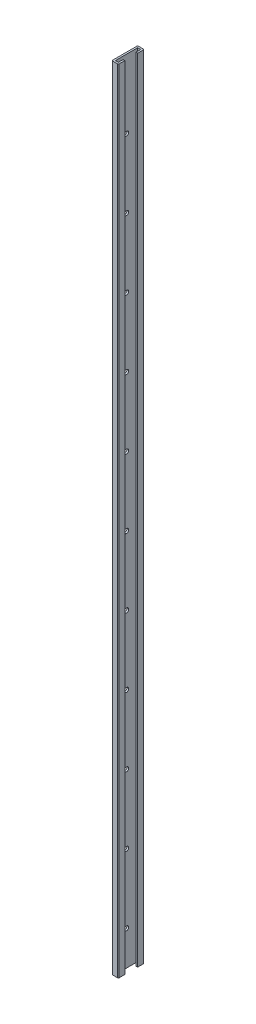
ISO-10303-21;
HEADER;
FILE_DESCRIPTION(('STEP AP214'),'2;1');
FILE_NAME('part.step','',(''),(''),'','','');
FILE_SCHEMA(('AUTOMOTIVE_DESIGN { 1 0 10303 214 1 1 1 1 }'));
ENDSEC;
DATA;
#1=APPLICATION_CONTEXT('core data for automotive mechanical design processes');
#2=APPLICATION_PROTOCOL_DEFINITION('international standard','automotive_design',2000,#1);
#3=PRODUCT_CONTEXT('',#1,'mechanical');
#4=PRODUCT('Part','Part','',(#3));
#5=PRODUCT_RELATED_PRODUCT_CATEGORY('part','',(#4));
#6=PRODUCT_DEFINITION_FORMATION('','',#4);
#7=PRODUCT_DEFINITION_CONTEXT('part definition',#1,'design');
#8=PRODUCT_DEFINITION('design','',#6,#7);
#9=PRODUCT_DEFINITION_SHAPE('','',#8);
#10=(LENGTH_UNIT() NAMED_UNIT(*) SI_UNIT(.MILLI.,.METRE.));
#11=(NAMED_UNIT(*) PLANE_ANGLE_UNIT() SI_UNIT($,.RADIAN.));
#12=(NAMED_UNIT(*) SI_UNIT($,.STERADIAN.) SOLID_ANGLE_UNIT());
#13=UNCERTAINTY_MEASURE_WITH_UNIT(LENGTH_MEASURE(1.E-05),#10,'distance_accuracy_value','');
#14=(GEOMETRIC_REPRESENTATION_CONTEXT(3) GLOBAL_UNCERTAINTY_ASSIGNED_CONTEXT((#13)) GLOBAL_UNIT_ASSIGNED_CONTEXT((#10,
#11,#12)) REPRESENTATION_CONTEXT('',''));
#15=CARTESIAN_POINT('',(0.,0.,0.));
#16=DIRECTION('',(0.,0.,1.));
#17=DIRECTION('',(1.,0.,0.));
#18=AXIS2_PLACEMENT_3D('',#15,#16,#17);
#19=CARTESIAN_POINT('',(2.54,1168.4,0.));
#20=DIRECTION('',(0.,0.,1.));
#21=DIRECTION('',(1.,0.,0.));
#22=AXIS2_PLACEMENT_3D('',#19,#20,#21);
#23=PLANE('',#22);
#24=DIRECTION('',(-1.,0.,0.));
#25=VECTOR('',#24,1.);
#26=CARTESIAN_POINT('',(2.54,0.,0.));
#27=LINE('',#26,#25);
#28=CARTESIAN_POINT('',(6.985,0.,0.));
#29=VERTEX_POINT('',#28);
#30=CARTESIAN_POINT('',(2.54,0.,0.));
#31=VERTEX_POINT('',#30);
#32=EDGE_CURVE('E220',#29,#31,#27,.T.);
#33=ORIENTED_EDGE('',*,*,#32,.T.);
#34=DIRECTION('',(0.,-1.,0.));
#35=VECTOR('',#34,1.);
#36=CARTESIAN_POINT('',(2.54,1168.4,0.));
#37=LINE('',#36,#35);
#38=CARTESIAN_POINT('',(2.54,1168.4,0.));
#39=VERTEX_POINT('',#38);
#40=EDGE_CURVE('E11',#39,#31,#37,.T.);
#41=ORIENTED_EDGE('',*,*,#40,.F.);
#42=DIRECTION('',(-1.,0.,0.));
#43=VECTOR('',#42,1.);
#44=CARTESIAN_POINT('',(2.54,1168.4,0.));
#45=LINE('',#44,#43);
#46=CARTESIAN_POINT('',(6.985,1168.4,0.));
#47=VERTEX_POINT('',#46);
#48=EDGE_CURVE('E267',#47,#39,#45,.T.);
#49=ORIENTED_EDGE('',*,*,#48,.F.);
#50=DIRECTION('',(0.,-1.,0.));
#51=VECTOR('',#50,1.);
#52=CARTESIAN_POINT('',(6.985,1168.4,0.));
#53=LINE('',#52,#51);
#54=EDGE_CURVE('E216',#47,#29,#53,.T.);
#55=ORIENTED_EDGE('',*,*,#54,.T.);
#56=EDGE_LOOP('',(#33,#41,#49,#55));
#57=FACE_BOUND('',#56,.T.);
#58=ADVANCED_FACE('F38',(#57),#23,.F.);
#59=CARTESIAN_POINT('',(2.54,1168.4,0.));
#60=DIRECTION('',(-1.,0.,0.));
#61=DIRECTION('',(0.,0.,1.));
#62=AXIS2_PLACEMENT_3D('',#59,#60,#61);
#63=PLANE('',#62);
#64=CARTESIAN_POINT('',(2.54,50.8,-16.51));
#65=DIRECTION('',(1.,0.,0.));
#66=DIRECTION('',(0.,0.,-1.));
#67=AXIS2_PLACEMENT_3D('',#64,#65,#66);
#68=CIRCLE('',#67,3.175);
#69=CARTESIAN_POINT('',(2.54,50.8,-19.685));
#70=VERTEX_POINT('',#69);
#71=EDGE_CURVE('E451',#70,#70,#68,.T.);
#72=ORIENTED_EDGE('',*,*,#71,.F.);
#73=EDGE_LOOP('',(#72));
#74=FACE_BOUND('',#73,.T.);
#75=CARTESIAN_POINT('',(2.54,152.4,-16.51));
#76=DIRECTION('',(1.,0.,0.));
#77=DIRECTION('',(0.,0.,-1.));
#78=AXIS2_PLACEMENT_3D('',#75,#76,#77);
#79=CIRCLE('',#78,3.175);
#80=CARTESIAN_POINT('',(2.54,152.4,-19.685));
#81=VERTEX_POINT('',#80);
#82=EDGE_CURVE('E443',#81,#81,#79,.T.);
#83=ORIENTED_EDGE('',*,*,#82,.F.);
#84=EDGE_LOOP('',(#83));
#85=FACE_BOUND('',#84,.T.);
#86=CARTESIAN_POINT('',(2.54,254.,-16.51));
#87=DIRECTION('',(1.,0.,0.));
#88=DIRECTION('',(0.,0.,-1.));
#89=AXIS2_PLACEMENT_3D('',#86,#87,#88);
#90=CIRCLE('',#89,3.175);
#91=CARTESIAN_POINT('',(2.54,254.,-19.685));
#92=VERTEX_POINT('',#91);
#93=EDGE_CURVE('E435',#92,#92,#90,.T.);
#94=ORIENTED_EDGE('',*,*,#93,.F.);
#95=EDGE_LOOP('',(#94));
#96=FACE_BOUND('',#95,.T.);
#97=CARTESIAN_POINT('',(2.54,355.6,-16.51));
#98=DIRECTION('',(1.,0.,0.));
#99=DIRECTION('',(0.,0.,-1.));
#100=AXIS2_PLACEMENT_3D('',#97,#98,#99);
#101=CIRCLE('',#100,3.175);
#102=CARTESIAN_POINT('',(2.54,355.6,-19.685));
#103=VERTEX_POINT('',#102);
#104=EDGE_CURVE('E427',#103,#103,#101,.T.);
#105=ORIENTED_EDGE('',*,*,#104,.F.);
#106=EDGE_LOOP('',(#105));
#107=FACE_BOUND('',#106,.T.);
#108=CARTESIAN_POINT('',(2.54,457.2,-16.51));
#109=DIRECTION('',(1.,0.,0.));
#110=DIRECTION('',(0.,0.,-1.));
#111=AXIS2_PLACEMENT_3D('',#108,#109,#110);
#112=CIRCLE('',#111,3.175);
#113=CARTESIAN_POINT('',(2.54,457.2,-19.685));
#114=VERTEX_POINT('',#113);
#115=EDGE_CURVE('E419',#114,#114,#112,.T.);
#116=ORIENTED_EDGE('',*,*,#115,.F.);
#117=EDGE_LOOP('',(#116));
#118=FACE_BOUND('',#117,.T.);
#119=CARTESIAN_POINT('',(2.54,558.8,-16.51));
#120=DIRECTION('',(1.,0.,0.));
#121=DIRECTION('',(0.,0.,-1.));
#122=AXIS2_PLACEMENT_3D('',#119,#120,#121);
#123=CIRCLE('',#122,3.175);
#124=CARTESIAN_POINT('',(2.54,558.8,-19.685));
#125=VERTEX_POINT('',#124);
#126=EDGE_CURVE('E411',#125,#125,#123,.T.);
#127=ORIENTED_EDGE('',*,*,#126,.F.);
#128=EDGE_LOOP('',(#127));
#129=FACE_BOUND('',#128,.T.);
#130=CARTESIAN_POINT('',(2.54,660.4,-16.51));
#131=DIRECTION('',(1.,0.,0.));
#132=DIRECTION('',(0.,0.,-1.));
#133=AXIS2_PLACEMENT_3D('',#130,#131,#132);
#134=CIRCLE('',#133,3.175);
#135=CARTESIAN_POINT('',(2.54,660.4,-19.685));
#136=VERTEX_POINT('',#135);
#137=EDGE_CURVE('E403',#136,#136,#134,.T.);
#138=ORIENTED_EDGE('',*,*,#137,.F.);
#139=EDGE_LOOP('',(#138));
#140=FACE_BOUND('',#139,.T.);
#141=CARTESIAN_POINT('',(2.54,762.,-16.51));
#142=DIRECTION('',(1.,0.,0.));
#143=DIRECTION('',(0.,0.,-1.));
#144=AXIS2_PLACEMENT_3D('',#141,#142,#143);
#145=CIRCLE('',#144,3.175);
#146=CARTESIAN_POINT('',(2.54,762.,-19.685));
#147=VERTEX_POINT('',#146);
#148=EDGE_CURVE('E385',#147,#147,#145,.T.);
#149=ORIENTED_EDGE('',*,*,#148,.F.);
#150=EDGE_LOOP('',(#149));
#151=FACE_BOUND('',#150,.T.);
#152=CARTESIAN_POINT('',(2.54,863.6,-16.51));
#153=DIRECTION('',(1.,0.,0.));
#154=DIRECTION('',(0.,0.,-1.));
#155=AXIS2_PLACEMENT_3D('',#152,#153,#154);
#156=CIRCLE('',#155,3.175);
#157=CARTESIAN_POINT('',(2.54,863.6,-19.685));
#158=VERTEX_POINT('',#157);
#159=EDGE_CURVE('E386',#158,#158,#156,.T.);
#160=ORIENTED_EDGE('',*,*,#159,.F.);
#161=EDGE_LOOP('',(#160));
#162=FACE_BOUND('',#161,.T.);
#163=CARTESIAN_POINT('',(2.54,965.2,-16.51));
#164=DIRECTION('',(1.,0.,0.));
#165=DIRECTION('',(0.,0.,-1.));
#166=AXIS2_PLACEMENT_3D('',#163,#164,#165);
#167=CIRCLE('',#166,3.175);
#168=CARTESIAN_POINT('',(2.54,965.2,-19.685));
#169=VERTEX_POINT('',#168);
#170=EDGE_CURVE('E380',#169,#169,#167,.T.);
#171=ORIENTED_EDGE('',*,*,#170,.F.);
#172=EDGE_LOOP('',(#171));
#173=FACE_BOUND('',#172,.T.);
#174=CARTESIAN_POINT('',(2.54,1066.8,-16.51));
#175=DIRECTION('',(1.,0.,0.));
#176=DIRECTION('',(0.,0.,-1.));
#177=AXIS2_PLACEMENT_3D('',#174,#175,#176);
#178=CIRCLE('',#177,3.17500000000003);
#179=CARTESIAN_POINT('',(2.54,1066.8,-19.685));
#180=VERTEX_POINT('',#179);
#181=EDGE_CURVE('E376',#180,#180,#178,.T.);
#182=ORIENTED_EDGE('',*,*,#181,.F.);
#183=EDGE_LOOP('',(#182));
#184=FACE_BOUND('',#183,.T.);
#185=DIRECTION('',(0.,0.,-1.));
#186=VECTOR('',#185,1.);
#187=CARTESIAN_POINT('',(2.54,0.,0.));
#188=LINE('',#187,#186);
#189=CARTESIAN_POINT('',(2.54,0.,-33.02));
#190=VERTEX_POINT('',#189);
#191=EDGE_CURVE('E224',#31,#190,#188,.T.);
#192=ORIENTED_EDGE('',*,*,#191,.T.);
#193=DIRECTION('',(0.,-1.,0.));
#194=VECTOR('',#193,1.);
#195=CARTESIAN_POINT('',(2.54,1168.4,-33.02));
#196=LINE('',#195,#194);
#197=CARTESIAN_POINT('',(2.54,1168.4,-33.02));
#198=VERTEX_POINT('',#197);
#199=EDGE_CURVE('E47',#198,#190,#196,.T.);
#200=ORIENTED_EDGE('',*,*,#199,.F.);
#201=DIRECTION('',(0.,0.,-1.));
#202=VECTOR('',#201,1.);
#203=CARTESIAN_POINT('',(2.54,1168.4,0.));
#204=LINE('',#203,#202);
#205=EDGE_CURVE('E145',#39,#198,#204,.T.);
#206=ORIENTED_EDGE('',*,*,#205,.F.);
#207=ORIENTED_EDGE('',*,*,#40,.T.);
#208=EDGE_LOOP('',(#192,#200,#206,#207));
#209=FACE_BOUND('',#208,.T.);
#210=ADVANCED_FACE('F465',(#74,#85,#96,#107,#118,#129,#140,#151,#162,#173,#184,#209),#63,.F.);
#211=CARTESIAN_POINT('',(2.54,1168.4,-33.02));
#212=DIRECTION('',(0.,0.,-1.));
#213=DIRECTION('',(-1.,0.,0.));
#214=AXIS2_PLACEMENT_3D('',#211,#212,#213);
#215=PLANE('',#214);
#216=DIRECTION('',(1.,0.,0.));
#217=VECTOR('',#216,1.);
#218=CARTESIAN_POINT('',(2.54,0.,-33.02));
#219=LINE('',#218,#217);
#220=CARTESIAN_POINT('',(6.985,0.,-33.02));
#221=VERTEX_POINT('',#220);
#222=EDGE_CURVE('E228',#190,#221,#219,.T.);
#223=ORIENTED_EDGE('',*,*,#222,.T.);
#224=DIRECTION('',(0.,-1.,0.));
#225=VECTOR('',#224,1.);
#226=CARTESIAN_POINT('',(6.985,1168.4,-33.02));
#227=LINE('',#226,#225);
#228=CARTESIAN_POINT('',(6.985,1168.4,-33.02));
#229=VERTEX_POINT('',#228);
#230=EDGE_CURVE('E310',#229,#221,#227,.T.);
#231=ORIENTED_EDGE('',*,*,#230,.F.);
#232=DIRECTION('',(1.,0.,0.));
#233=VECTOR('',#232,1.);
#234=CARTESIAN_POINT('',(2.54,1168.4,-33.02));
#235=LINE('',#234,#233);
#236=EDGE_CURVE('E320',#198,#229,#235,.T.);
#237=ORIENTED_EDGE('',*,*,#236,.F.);
#238=ORIENTED_EDGE('',*,*,#199,.T.);
#239=EDGE_LOOP('',(#223,#231,#237,#238));
#240=FACE_BOUND('',#239,.T.);
#241=ADVANCED_FACE('F318',(#240),#215,.F.);
#242=CARTESIAN_POINT('',(6.985,1168.4,-33.02));
#243=DIRECTION('',(1.,0.,0.));
#244=DIRECTION('',(0.,0.,-1.));
#245=AXIS2_PLACEMENT_3D('',#242,#243,#244);
#246=PLANE('',#245);
#247=DIRECTION('',(0.,0.,1.));
#248=VECTOR('',#247,1.);
#249=CARTESIAN_POINT('',(6.985,0.,-33.02));
#250=LINE('',#249,#248);
#251=CARTESIAN_POINT('',(6.985,0.,-26.035));
#252=VERTEX_POINT('',#251);
#253=EDGE_CURVE('E231',#221,#252,#250,.T.);
#254=ORIENTED_EDGE('',*,*,#253,.T.);
#255=DIRECTION('',(0.,-1.,0.));
#256=VECTOR('',#255,1.);
#257=CARTESIAN_POINT('',(6.985,1168.4,-26.035));
#258=LINE('',#257,#256);
#259=CARTESIAN_POINT('',(6.985,1168.4,-26.035));
#260=VERTEX_POINT('',#259);
#261=EDGE_CURVE('E306',#260,#252,#258,.T.);
#262=ORIENTED_EDGE('',*,*,#261,.F.);
#263=DIRECTION('',(0.,0.,1.));
#264=VECTOR('',#263,1.);
#265=CARTESIAN_POINT('',(6.985,1168.4,-33.02));
#266=LINE('',#265,#264);
#267=EDGE_CURVE('E339',#229,#260,#266,.T.);
#268=ORIENTED_EDGE('',*,*,#267,.F.);
#269=ORIENTED_EDGE('',*,*,#230,.T.);
#270=EDGE_LOOP('',(#254,#262,#268,#269));
#271=FACE_BOUND('',#270,.T.);
#272=ADVANCED_FACE('F329',(#271),#246,.F.);
#273=CARTESIAN_POINT('',(9.525,1168.4,-26.035));
#274=DIRECTION('',(0.,0.,-1.));
#275=DIRECTION('',(-1.,0.,0.));
#276=AXIS2_PLACEMENT_3D('',#273,#274,#275);
#277=PLANE('',#276);
#278=DIRECTION('',(1.,0.,0.));
#279=VECTOR('',#278,1.);
#280=CARTESIAN_POINT('',(9.525,0.,-26.035));
#281=LINE('',#280,#279);
#282=CARTESIAN_POINT('',(9.525,0.,-26.035));
#283=VERTEX_POINT('',#282);
#284=EDGE_CURVE('E234',#252,#283,#281,.T.);
#285=ORIENTED_EDGE('',*,*,#284,.T.);
#286=DIRECTION('',(0.,-1.,0.));
#287=VECTOR('',#286,1.);
#288=CARTESIAN_POINT('',(9.525,1168.4,-26.035));
#289=LINE('',#288,#287);
#290=CARTESIAN_POINT('',(9.525,1168.4,-26.035));
#291=VERTEX_POINT('',#290);
#292=EDGE_CURVE('E302',#291,#283,#289,.T.);
#293=ORIENTED_EDGE('',*,*,#292,.F.);
#294=DIRECTION('',(1.,0.,0.));
#295=VECTOR('',#294,1.);
#296=CARTESIAN_POINT('',(9.525,1168.4,-26.035));
#297=LINE('',#296,#295);
#298=EDGE_CURVE('E335',#260,#291,#297,.T.);
#299=ORIENTED_EDGE('',*,*,#298,.F.);
#300=ORIENTED_EDGE('',*,*,#261,.T.);
#301=EDGE_LOOP('',(#285,#293,#299,#300));
#302=FACE_BOUND('',#301,.T.);
#303=ADVANCED_FACE('F333',(#302),#277,.F.);
#304=CARTESIAN_POINT('',(9.525,1168.4,-34.29));
#305=DIRECTION('',(-1.,0.,0.));
#306=DIRECTION('',(0.,0.,1.));
#307=AXIS2_PLACEMENT_3D('',#304,#305,#306);
#308=PLANE('',#307);
#309=DIRECTION('',(0.,0.,-1.));
#310=VECTOR('',#309,1.);
#311=CARTESIAN_POINT('',(9.525,0.,-34.29));
#312=LINE('',#311,#310);
#313=CARTESIAN_POINT('',(9.525,0.,-34.29));
#314=VERTEX_POINT('',#313);
#315=EDGE_CURVE('E237',#283,#314,#312,.T.);
#316=ORIENTED_EDGE('',*,*,#315,.T.);
#317=DIRECTION('',(0.,-1.,0.));
#318=VECTOR('',#317,1.);
#319=CARTESIAN_POINT('',(9.525,1168.4,-34.29));
#320=LINE('',#319,#318);
#321=CARTESIAN_POINT('',(9.525,1168.4,-34.29));
#322=VERTEX_POINT('',#321);
#323=EDGE_CURVE('E298',#322,#314,#320,.T.);
#324=ORIENTED_EDGE('',*,*,#323,.F.);
#325=DIRECTION('',(0.,0.,-1.));
#326=VECTOR('',#325,1.);
#327=CARTESIAN_POINT('',(9.525,1168.4,-34.29));
#328=LINE('',#327,#326);
#329=EDGE_CURVE('E338',#291,#322,#328,.T.);
#330=ORIENTED_EDGE('',*,*,#329,.F.);
#331=ORIENTED_EDGE('',*,*,#292,.T.);
#332=EDGE_LOOP('',(#316,#324,#330,#331));
#333=FACE_BOUND('',#332,.T.);
#334=ADVANCED_FACE('F523',(#333),#308,.F.);
#335=CARTESIAN_POINT('',(8.255,1168.4,-34.29));
#336=DIRECTION('',(0.,-1.,0.));
#337=DIRECTION('',(0.,0.,-1.));
#338=AXIS2_PLACEMENT_3D('',#335,#336,#337);
#339=CYLINDRICAL_SURFACE('',#338,1.27);
#340=CARTESIAN_POINT('',(8.255,0.,-34.29));
#341=DIRECTION('',(0.,1.,0.));
#342=DIRECTION('',(0.,0.,-1.));
#343=AXIS2_PLACEMENT_3D('',#340,#341,#342);
#344=CIRCLE('',#343,1.27);
#345=CARTESIAN_POINT('',(8.255,0.,-35.56));
#346=VERTEX_POINT('',#345);
#347=EDGE_CURVE('E240',#314,#346,#344,.T.);
#348=ORIENTED_EDGE('',*,*,#347,.T.);
#349=DIRECTION('',(0.,-1.,0.));
#350=VECTOR('',#349,1.);
#351=CARTESIAN_POINT('',(8.255,1168.4,-35.56));
#352=LINE('',#351,#350);
#353=CARTESIAN_POINT('',(8.255,1168.4,-35.56));
#354=VERTEX_POINT('',#353);
#355=EDGE_CURVE('E294',#354,#346,#352,.T.);
#356=ORIENTED_EDGE('',*,*,#355,.F.);
#357=CARTESIAN_POINT('',(8.255,1168.4,-34.29));
#358=DIRECTION('',(0.,1.,0.));
#359=DIRECTION('',(0.,0.,-1.));
#360=AXIS2_PLACEMENT_3D('',#357,#358,#359);
#361=CIRCLE('',#360,1.27);
#362=EDGE_CURVE('E343',#322,#354,#361,.T.);
#363=ORIENTED_EDGE('',*,*,#362,.F.);
#364=ORIENTED_EDGE('',*,*,#323,.T.);
#365=EDGE_LOOP('',(#348,#356,#363,#364));
#366=FACE_BOUND('',#365,.T.);
#367=ADVANCED_FACE('F519',(#366),#339,.T.);
#368=CARTESIAN_POINT('',(1.27,1168.4,-35.56));
#369=DIRECTION('',(0.,0.,1.));
#370=DIRECTION('',(1.,0.,0.));
#371=AXIS2_PLACEMENT_3D('',#368,#369,#370);
#372=PLANE('',#371);
#373=DIRECTION('',(-1.,0.,0.));
#374=VECTOR('',#373,1.);
#375=CARTESIAN_POINT('',(1.27,0.,-35.56));
#376=LINE('',#375,#374);
#377=CARTESIAN_POINT('',(1.27,0.,-35.56));
#378=VERTEX_POINT('',#377);
#379=EDGE_CURVE('E243',#346,#378,#376,.T.);
#380=ORIENTED_EDGE('',*,*,#379,.T.);
#381=DIRECTION('',(0.,-1.,0.));
#382=VECTOR('',#381,1.);
#383=CARTESIAN_POINT('',(1.27,1168.4,-35.56));
#384=LINE('',#383,#382);
#385=CARTESIAN_POINT('',(1.27,1168.4,-35.56));
#386=VERTEX_POINT('',#385);
#387=EDGE_CURVE('E290',#386,#378,#384,.T.);
#388=ORIENTED_EDGE('',*,*,#387,.F.);
#389=DIRECTION('',(-1.,0.,0.));
#390=VECTOR('',#389,1.);
#391=CARTESIAN_POINT('',(1.27,1168.4,-35.56));
#392=LINE('',#391,#390);
#393=EDGE_CURVE('E351',#354,#386,#392,.T.);
#394=ORIENTED_EDGE('',*,*,#393,.F.);
#395=ORIENTED_EDGE('',*,*,#355,.T.);
#396=EDGE_LOOP('',(#380,#388,#394,#395));
#397=FACE_BOUND('',#396,.T.);
#398=ADVANCED_FACE('F515',(#397),#372,.F.);
#399=CARTESIAN_POINT('',(1.27,1168.4,-34.29));
#400=DIRECTION('',(0.,-1.,0.));
#401=DIRECTION('',(0.,0.,-1.));
#402=AXIS2_PLACEMENT_3D('',#399,#400,#401);
#403=CYLINDRICAL_SURFACE('',#402,1.27);
#404=CARTESIAN_POINT('',(1.27,0.,-34.29));
#405=DIRECTION('',(0.,1.,0.));
#406=DIRECTION('',(0.,0.,-1.));
#407=AXIS2_PLACEMENT_3D('',#404,#405,#406);
#408=CIRCLE('',#407,1.27);
#409=CARTESIAN_POINT('',(0.,0.,-34.29));
#410=VERTEX_POINT('',#409);
#411=EDGE_CURVE('E246',#378,#410,#408,.T.);
#412=ORIENTED_EDGE('',*,*,#411,.T.);
#413=DIRECTION('',(0.,-1.,0.));
#414=VECTOR('',#413,1.);
#415=CARTESIAN_POINT('',(0.,1168.4,-34.29));
#416=LINE('',#415,#414);
#417=CARTESIAN_POINT('',(0.,1168.4,-34.29));
#418=VERTEX_POINT('',#417);
#419=EDGE_CURVE('E286',#418,#410,#416,.T.);
#420=ORIENTED_EDGE('',*,*,#419,.F.);
#421=CARTESIAN_POINT('',(1.27,1168.4,-34.29));
#422=DIRECTION('',(0.,1.,0.));
#423=DIRECTION('',(0.,0.,-1.));
#424=AXIS2_PLACEMENT_3D('',#421,#422,#423);
#425=CIRCLE('',#424,1.27);
#426=EDGE_CURVE('E354',#386,#418,#425,.T.);
#427=ORIENTED_EDGE('',*,*,#426,.F.);
#428=ORIENTED_EDGE('',*,*,#387,.T.);
#429=EDGE_LOOP('',(#412,#420,#427,#428));
#430=FACE_BOUND('',#429,.T.);
#431=ADVANCED_FACE('F511',(#430),#403,.T.);
#432=CARTESIAN_POINT('',(0.,1168.4,1.27));
#433=DIRECTION('',(1.,0.,0.));
#434=DIRECTION('',(0.,0.,-1.));
#435=AXIS2_PLACEMENT_3D('',#432,#433,#434);
#436=PLANE('',#435);
#437=CARTESIAN_POINT('',(0.,50.8,-16.51));
#438=DIRECTION('',(1.,0.,0.));
#439=DIRECTION('',(0.,0.,-1.));
#440=AXIS2_PLACEMENT_3D('',#437,#438,#439);
#441=CIRCLE('',#440,3.175);
#442=CARTESIAN_POINT('',(0.,50.8,-19.685));
#443=VERTEX_POINT('',#442);
#444=EDGE_CURVE('E225',#443,#443,#441,.F.);
#445=ORIENTED_EDGE('',*,*,#444,.F.);
#446=EDGE_LOOP('',(#445));
#447=FACE_BOUND('',#446,.T.);
#448=CARTESIAN_POINT('',(0.,152.4,-16.51));
#449=DIRECTION('',(1.,0.,0.));
#450=DIRECTION('',(0.,0.,-1.));
#451=AXIS2_PLACEMENT_3D('',#448,#449,#450);
#452=CIRCLE('',#451,3.175);
#453=CARTESIAN_POINT('',(0.,152.4,-19.685));
#454=VERTEX_POINT('',#453);
#455=EDGE_CURVE('E447',#454,#454,#452,.F.);
#456=ORIENTED_EDGE('',*,*,#455,.F.);
#457=EDGE_LOOP('',(#456));
#458=FACE_BOUND('',#457,.T.);
#459=CARTESIAN_POINT('',(0.,254.,-16.51));
#460=DIRECTION('',(1.,0.,0.));
#461=DIRECTION('',(0.,0.,-1.));
#462=AXIS2_PLACEMENT_3D('',#459,#460,#461);
#463=CIRCLE('',#462,3.175);
#464=CARTESIAN_POINT('',(0.,254.,-19.685));
#465=VERTEX_POINT('',#464);
#466=EDGE_CURVE('E439',#465,#465,#463,.F.);
#467=ORIENTED_EDGE('',*,*,#466,.F.);
#468=EDGE_LOOP('',(#467));
#469=FACE_BOUND('',#468,.T.);
#470=CARTESIAN_POINT('',(0.,355.6,-16.51));
#471=DIRECTION('',(1.,0.,0.));
#472=DIRECTION('',(0.,0.,-1.));
#473=AXIS2_PLACEMENT_3D('',#470,#471,#472);
#474=CIRCLE('',#473,3.175);
#475=CARTESIAN_POINT('',(0.,355.6,-19.685));
#476=VERTEX_POINT('',#475);
#477=EDGE_CURVE('E431',#476,#476,#474,.F.);
#478=ORIENTED_EDGE('',*,*,#477,.F.);
#479=EDGE_LOOP('',(#478));
#480=FACE_BOUND('',#479,.T.);
#481=CARTESIAN_POINT('',(0.,457.2,-16.51));
#482=DIRECTION('',(1.,0.,0.));
#483=DIRECTION('',(0.,0.,-1.));
#484=AXIS2_PLACEMENT_3D('',#481,#482,#483);
#485=CIRCLE('',#484,3.175);
#486=CARTESIAN_POINT('',(0.,457.2,-19.685));
#487=VERTEX_POINT('',#486);
#488=EDGE_CURVE('E423',#487,#487,#485,.F.);
#489=ORIENTED_EDGE('',*,*,#488,.F.);
#490=EDGE_LOOP('',(#489));
#491=FACE_BOUND('',#490,.T.);
#492=CARTESIAN_POINT('',(0.,558.8,-16.51));
#493=DIRECTION('',(1.,0.,0.));
#494=DIRECTION('',(0.,0.,-1.));
#495=AXIS2_PLACEMENT_3D('',#492,#493,#494);
#496=CIRCLE('',#495,3.175);
#497=CARTESIAN_POINT('',(0.,558.8,-19.685));
#498=VERTEX_POINT('',#497);
#499=EDGE_CURVE('E415',#498,#498,#496,.F.);
#500=ORIENTED_EDGE('',*,*,#499,.F.);
#501=EDGE_LOOP('',(#500));
#502=FACE_BOUND('',#501,.T.);
#503=CARTESIAN_POINT('',(0.,660.4,-16.51));
#504=DIRECTION('',(1.,0.,0.));
#505=DIRECTION('',(0.,0.,-1.));
#506=AXIS2_PLACEMENT_3D('',#503,#504,#505);
#507=CIRCLE('',#506,3.175);
#508=CARTESIAN_POINT('',(0.,660.4,-19.685));
#509=VERTEX_POINT('',#508);
#510=EDGE_CURVE('E407',#509,#509,#507,.F.);
#511=ORIENTED_EDGE('',*,*,#510,.F.);
#512=EDGE_LOOP('',(#511));
#513=FACE_BOUND('',#512,.T.);
#514=CARTESIAN_POINT('',(0.,762.,-16.51));
#515=DIRECTION('',(1.,0.,0.));
#516=DIRECTION('',(0.,0.,-1.));
#517=AXIS2_PLACEMENT_3D('',#514,#515,#516);
#518=CIRCLE('',#517,3.175);
#519=CARTESIAN_POINT('',(0.,762.,-19.685));
#520=VERTEX_POINT('',#519);
#521=EDGE_CURVE('E399',#520,#520,#518,.F.);
#522=ORIENTED_EDGE('',*,*,#521,.F.);
#523=EDGE_LOOP('',(#522));
#524=FACE_BOUND('',#523,.T.);
#525=CARTESIAN_POINT('',(0.,863.6,-16.51));
#526=DIRECTION('',(1.,0.,0.));
#527=DIRECTION('',(0.,0.,-1.));
#528=AXIS2_PLACEMENT_3D('',#525,#526,#527);
#529=CIRCLE('',#528,3.175);
#530=CARTESIAN_POINT('',(0.,863.6,-19.685));
#531=VERTEX_POINT('',#530);
#532=EDGE_CURVE('E382',#531,#531,#529,.F.);
#533=ORIENTED_EDGE('',*,*,#532,.F.);
#534=EDGE_LOOP('',(#533));
#535=FACE_BOUND('',#534,.T.);
#536=CARTESIAN_POINT('',(0.,965.2,-16.51));
#537=DIRECTION('',(1.,0.,0.));
#538=DIRECTION('',(0.,0.,-1.));
#539=AXIS2_PLACEMENT_3D('',#536,#537,#538);
#540=CIRCLE('',#539,3.175);
#541=CARTESIAN_POINT('',(0.,965.2,-19.685));
#542=VERTEX_POINT('',#541);
#543=EDGE_CURVE('E390',#542,#542,#540,.F.);
#544=ORIENTED_EDGE('',*,*,#543,.F.);
#545=EDGE_LOOP('',(#544));
#546=FACE_BOUND('',#545,.T.);
#547=CARTESIAN_POINT('',(0.,1066.8,-16.51));
#548=DIRECTION('',(1.,0.,0.));
#549=DIRECTION('',(0.,0.,-1.));
#550=AXIS2_PLACEMENT_3D('',#547,#548,#549);
#551=CIRCLE('',#550,3.17500000000003);
#552=CARTESIAN_POINT('',(0.,1066.8,-19.685));
#553=VERTEX_POINT('',#552);
#554=EDGE_CURVE('E373',#553,#553,#551,.F.);
#555=ORIENTED_EDGE('',*,*,#554,.F.);
#556=EDGE_LOOP('',(#555));
#557=FACE_BOUND('',#556,.T.);
#558=DIRECTION('',(0.,0.,1.));
#559=VECTOR('',#558,1.);
#560=CARTESIAN_POINT('',(0.,0.,1.27));
#561=LINE('',#560,#559);
#562=CARTESIAN_POINT('',(0.,0.,1.27));
#563=VERTEX_POINT('',#562);
#564=EDGE_CURVE('E249',#410,#563,#561,.T.);
#565=ORIENTED_EDGE('',*,*,#564,.T.);
#566=DIRECTION('',(0.,-1.,0.));
#567=VECTOR('',#566,1.);
#568=CARTESIAN_POINT('',(0.,1168.4,1.27));
#569=LINE('',#568,#567);
#570=CARTESIAN_POINT('',(0.,1168.4,1.27));
#571=VERTEX_POINT('',#570);
#572=EDGE_CURVE('E282',#571,#563,#569,.T.);
#573=ORIENTED_EDGE('',*,*,#572,.F.);
#574=DIRECTION('',(0.,0.,1.));
#575=VECTOR('',#574,1.);
#576=CARTESIAN_POINT('',(0.,1168.4,1.27));
#577=LINE('',#576,#575);
#578=EDGE_CURVE('E357',#418,#571,#577,.T.);
#579=ORIENTED_EDGE('',*,*,#578,.F.);
#580=ORIENTED_EDGE('',*,*,#419,.T.);
#581=EDGE_LOOP('',(#565,#573,#579,#580));
#582=FACE_BOUND('',#581,.T.);
#583=ADVANCED_FACE('F506',(#447,#458,#469,#480,#491,#502,#513,#524,#535,#546,#557,#582),#436,.F.);
#584=CARTESIAN_POINT('',(1.27,1168.4,1.27));
#585=DIRECTION('',(0.,-1.,0.));
#586=DIRECTION('',(0.,0.,-1.));
#587=AXIS2_PLACEMENT_3D('',#584,#585,#586);
#588=CYLINDRICAL_SURFACE('',#587,1.27);
#589=CARTESIAN_POINT('',(1.27,0.,1.27));
#590=DIRECTION('',(0.,1.,0.));
#591=DIRECTION('',(0.,0.,-1.));
#592=AXIS2_PLACEMENT_3D('',#589,#590,#591);
#593=CIRCLE('',#592,1.27);
#594=CARTESIAN_POINT('',(1.27,0.,2.54));
#595=VERTEX_POINT('',#594);
#596=EDGE_CURVE('E252',#563,#595,#593,.T.);
#597=ORIENTED_EDGE('',*,*,#596,.T.);
#598=DIRECTION('',(0.,-1.,0.));
#599=VECTOR('',#598,1.);
#600=CARTESIAN_POINT('',(1.27,1168.4,2.54));
#601=LINE('',#600,#599);
#602=CARTESIAN_POINT('',(1.27,1168.4,2.54));
#603=VERTEX_POINT('',#602);
#604=EDGE_CURVE('E278',#603,#595,#601,.T.);
#605=ORIENTED_EDGE('',*,*,#604,.F.);
#606=CARTESIAN_POINT('',(1.27,1168.4,1.27));
#607=DIRECTION('',(0.,1.,0.));
#608=DIRECTION('',(0.,0.,-1.));
#609=AXIS2_PLACEMENT_3D('',#606,#607,#608);
#610=CIRCLE('',#609,1.27);
#611=EDGE_CURVE('E360',#571,#603,#610,.T.);
#612=ORIENTED_EDGE('',*,*,#611,.F.);
#613=ORIENTED_EDGE('',*,*,#572,.T.);
#614=EDGE_LOOP('',(#597,#605,#612,#613));
#615=FACE_BOUND('',#614,.T.);
#616=ADVANCED_FACE('F500',(#615),#588,.T.);
#617=CARTESIAN_POINT('',(1.27,1168.4,2.54));
#618=DIRECTION('',(0.,0.,-1.));
#619=DIRECTION('',(-1.,0.,0.));
#620=AXIS2_PLACEMENT_3D('',#617,#618,#619);
#621=PLANE('',#620);
#622=DIRECTION('',(1.,0.,0.));
#623=VECTOR('',#622,1.);
#624=CARTESIAN_POINT('',(1.27,0.,2.54));
#625=LINE('',#624,#623);
#626=CARTESIAN_POINT('',(8.255,0.,2.54));
#627=VERTEX_POINT('',#626);
#628=EDGE_CURVE('E255',#595,#627,#625,.T.);
#629=ORIENTED_EDGE('',*,*,#628,.T.);
#630=DIRECTION('',(0.,-1.,0.));
#631=VECTOR('',#630,1.);
#632=CARTESIAN_POINT('',(8.255,1168.4,2.54));
#633=LINE('',#632,#631);
#634=CARTESIAN_POINT('',(8.255,1168.4,2.54));
#635=VERTEX_POINT('',#634);
#636=EDGE_CURVE('E274',#635,#627,#633,.T.);
#637=ORIENTED_EDGE('',*,*,#636,.F.);
#638=DIRECTION('',(1.,0.,0.));
#639=VECTOR('',#638,1.);
#640=CARTESIAN_POINT('',(1.27,1168.4,2.54));
#641=LINE('',#640,#639);
#642=EDGE_CURVE('E363',#603,#635,#641,.T.);
#643=ORIENTED_EDGE('',*,*,#642,.F.);
#644=ORIENTED_EDGE('',*,*,#604,.T.);
#645=EDGE_LOOP('',(#629,#637,#643,#644));
#646=FACE_BOUND('',#645,.T.);
#647=ADVANCED_FACE('F496',(#646),#621,.F.);
#648=CARTESIAN_POINT('',(8.255,1168.4,1.27));
#649=DIRECTION('',(0.,-1.,0.));
#650=DIRECTION('',(0.,0.,-1.));
#651=AXIS2_PLACEMENT_3D('',#648,#649,#650);
#652=CYLINDRICAL_SURFACE('',#651,1.27);
#653=CARTESIAN_POINT('',(8.255,0.,1.27));
#654=DIRECTION('',(0.,1.,0.));
#655=DIRECTION('',(0.,0.,1.));
#656=AXIS2_PLACEMENT_3D('',#653,#654,#655);
#657=CIRCLE('',#656,1.27);
#658=CARTESIAN_POINT('',(9.525,0.,1.27));
#659=VERTEX_POINT('',#658);
#660=EDGE_CURVE('E258',#627,#659,#657,.T.);
#661=ORIENTED_EDGE('',*,*,#660,.T.);
#662=DIRECTION('',(0.,-1.,0.));
#663=VECTOR('',#662,1.);
#664=CARTESIAN_POINT('',(9.525,1168.4,1.27));
#665=LINE('',#664,#663);
#666=CARTESIAN_POINT('',(9.525,1168.4,1.27));
#667=VERTEX_POINT('',#666);
#668=EDGE_CURVE('E208',#667,#659,#665,.T.);
#669=ORIENTED_EDGE('',*,*,#668,.F.);
#670=CARTESIAN_POINT('',(8.255,1168.4,1.27));
#671=DIRECTION('',(0.,1.,0.));
#672=DIRECTION('',(0.,0.,1.));
#673=AXIS2_PLACEMENT_3D('',#670,#671,#672);
#674=CIRCLE('',#673,1.27);
#675=EDGE_CURVE('E197',#635,#667,#674,.T.);
#676=ORIENTED_EDGE('',*,*,#675,.F.);
#677=ORIENTED_EDGE('',*,*,#636,.T.);
#678=EDGE_LOOP('',(#661,#669,#676,#677));
#679=FACE_BOUND('',#678,.T.);
#680=ADVANCED_FACE('F492',(#679),#652,.T.);
#681=CARTESIAN_POINT('',(9.525,1168.4,1.27));
#682=DIRECTION('',(-1.,0.,0.));
#683=DIRECTION('',(0.,0.,1.));
#684=AXIS2_PLACEMENT_3D('',#681,#682,#683);
#685=PLANE('',#684);
#686=DIRECTION('',(0.,0.,-1.));
#687=VECTOR('',#686,1.);
#688=CARTESIAN_POINT('',(9.525,0.,1.27));
#689=LINE('',#688,#687);
#690=CARTESIAN_POINT('',(9.525,0.,-6.985));
#691=VERTEX_POINT('',#690);
#692=EDGE_CURVE('E206',#659,#691,#689,.T.);
#693=ORIENTED_EDGE('',*,*,#692,.T.);
#694=DIRECTION('',(0.,-1.,0.));
#695=VECTOR('',#694,1.);
#696=CARTESIAN_POINT('',(9.525,1168.4,-6.985));
#697=LINE('',#696,#695);
#698=CARTESIAN_POINT('',(9.525,1168.4,-6.985));
#699=VERTEX_POINT('',#698);
#700=EDGE_CURVE('E203',#699,#691,#697,.T.);
#701=ORIENTED_EDGE('',*,*,#700,.F.);
#702=DIRECTION('',(0.,0.,-1.));
#703=VECTOR('',#702,1.);
#704=CARTESIAN_POINT('',(9.525,1168.4,1.27));
#705=LINE('',#704,#703);
#706=EDGE_CURVE('E191',#667,#699,#705,.T.);
#707=ORIENTED_EDGE('',*,*,#706,.F.);
#708=ORIENTED_EDGE('',*,*,#668,.T.);
#709=EDGE_LOOP('',(#693,#701,#707,#708));
#710=FACE_BOUND('',#709,.T.);
#711=ADVANCED_FACE('F204',(#710),#685,.F.);
#712=CARTESIAN_POINT('',(9.525,1168.4,-6.985));
#713=DIRECTION('',(0.,0.,1.));
#714=DIRECTION('',(1.,0.,0.));
#715=AXIS2_PLACEMENT_3D('',#712,#713,#714);
#716=PLANE('',#715);
#717=DIRECTION('',(-1.,0.,0.));
#718=VECTOR('',#717,1.);
#719=CARTESIAN_POINT('',(9.525,0.,-6.985));
#720=LINE('',#719,#718);
#721=CARTESIAN_POINT('',(6.985,0.,-6.985));
#722=VERTEX_POINT('',#721);
#723=EDGE_CURVE('E127',#691,#722,#720,.T.);
#724=ORIENTED_EDGE('',*,*,#723,.T.);
#725=DIRECTION('',(0.,-1.,0.));
#726=VECTOR('',#725,1.);
#727=CARTESIAN_POINT('',(6.985,1168.4,-6.985));
#728=LINE('',#727,#726);
#729=CARTESIAN_POINT('',(6.985,1168.4,-6.985));
#730=VERTEX_POINT('',#729);
#731=EDGE_CURVE('E209',#730,#722,#728,.T.);
#732=ORIENTED_EDGE('',*,*,#731,.F.);
#733=DIRECTION('',(-1.,0.,0.));
#734=VECTOR('',#733,1.);
#735=CARTESIAN_POINT('',(9.525,1168.4,-6.985));
#736=LINE('',#735,#734);
#737=EDGE_CURVE('E195',#699,#730,#736,.T.);
#738=ORIENTED_EDGE('',*,*,#737,.F.);
#739=ORIENTED_EDGE('',*,*,#700,.T.);
#740=EDGE_LOOP('',(#724,#732,#738,#739));
#741=FACE_BOUND('',#740,.T.);
#742=ADVANCED_FACE('F211',(#741),#716,.F.);
#743=CARTESIAN_POINT('',(6.985,1168.4,0.));
#744=DIRECTION('',(1.,0.,0.));
#745=DIRECTION('',(0.,0.,-1.));
#746=AXIS2_PLACEMENT_3D('',#743,#744,#745);
#747=PLANE('',#746);
#748=DIRECTION('',(0.,0.,1.));
#749=VECTOR('',#748,1.);
#750=CARTESIAN_POINT('',(6.985,0.,0.));
#751=LINE('',#750,#749);
#752=EDGE_CURVE('E134',#722,#29,#751,.T.);
#753=ORIENTED_EDGE('',*,*,#752,.T.);
#754=ORIENTED_EDGE('',*,*,#54,.F.);
#755=DIRECTION('',(0.,0.,1.));
#756=VECTOR('',#755,1.);
#757=CARTESIAN_POINT('',(6.985,1168.4,0.));
#758=LINE('',#757,#756);
#759=EDGE_CURVE('E58',#730,#47,#758,.T.);
#760=ORIENTED_EDGE('',*,*,#759,.F.);
#761=ORIENTED_EDGE('',*,*,#731,.T.);
#762=EDGE_LOOP('',(#753,#754,#760,#761));
#763=FACE_BOUND('',#762,.T.);
#764=ADVANCED_FACE('F628',(#763),#747,.F.);
#765=CARTESIAN_POINT('',(8.255,1168.4,1.27));
#766=DIRECTION('',(0.,1.,0.));
#767=DIRECTION('',(0.,0.,1.));
#768=AXIS2_PLACEMENT_3D('',#765,#766,#767);
#769=PLANE('',#768);
#770=ORIENTED_EDGE('',*,*,#48,.T.);
#771=ORIENTED_EDGE('',*,*,#205,.T.);
#772=ORIENTED_EDGE('',*,*,#236,.T.);
#773=ORIENTED_EDGE('',*,*,#267,.T.);
#774=ORIENTED_EDGE('',*,*,#298,.T.);
#775=ORIENTED_EDGE('',*,*,#329,.T.);
#776=ORIENTED_EDGE('',*,*,#362,.T.);
#777=ORIENTED_EDGE('',*,*,#393,.T.);
#778=ORIENTED_EDGE('',*,*,#426,.T.);
#779=ORIENTED_EDGE('',*,*,#578,.T.);
#780=ORIENTED_EDGE('',*,*,#611,.T.);
#781=ORIENTED_EDGE('',*,*,#642,.T.);
#782=ORIENTED_EDGE('',*,*,#675,.T.);
#783=ORIENTED_EDGE('',*,*,#706,.T.);
#784=ORIENTED_EDGE('',*,*,#737,.T.);
#785=ORIENTED_EDGE('',*,*,#759,.T.);
#786=EDGE_LOOP('',(#770,#771,#772,#773,#774,#775,#776,#777,#778,#779,#780,#781,#782,#783,#784,#785));
#787=FACE_BOUND('',#786,.T.);
#788=ADVANCED_FACE('F193',(#787),#769,.T.);
#789=CARTESIAN_POINT('',(8.255,0.,1.27));
#790=DIRECTION('',(0.,1.,0.));
#791=DIRECTION('',(0.,0.,1.));
#792=AXIS2_PLACEMENT_3D('',#789,#790,#791);
#793=PLANE('',#792);
#794=ORIENTED_EDGE('',*,*,#32,.F.);
#795=ORIENTED_EDGE('',*,*,#752,.F.);
#796=ORIENTED_EDGE('',*,*,#723,.F.);
#797=ORIENTED_EDGE('',*,*,#692,.F.);
#798=ORIENTED_EDGE('',*,*,#660,.F.);
#799=ORIENTED_EDGE('',*,*,#628,.F.);
#800=ORIENTED_EDGE('',*,*,#596,.F.);
#801=ORIENTED_EDGE('',*,*,#564,.F.);
#802=ORIENTED_EDGE('',*,*,#411,.F.);
#803=ORIENTED_EDGE('',*,*,#379,.F.);
#804=ORIENTED_EDGE('',*,*,#347,.F.);
#805=ORIENTED_EDGE('',*,*,#315,.F.);
#806=ORIENTED_EDGE('',*,*,#284,.F.);
#807=ORIENTED_EDGE('',*,*,#253,.F.);
#808=ORIENTED_EDGE('',*,*,#222,.F.);
#809=ORIENTED_EDGE('',*,*,#191,.F.);
#810=EDGE_LOOP('',(#794,#795,#796,#797,#798,#799,#800,#801,#802,#803,#804,#805,#806,#807,#808,#809));
#811=FACE_BOUND('',#810,.T.);
#812=ADVANCED_FACE('F324',(#811),#793,.F.);
#813=CARTESIAN_POINT('',(-0.000999999999999265,1066.8,-16.51));
#814=DIRECTION('',(1.,0.,0.));
#815=DIRECTION('',(0.,0.,-1.));
#816=AXIS2_PLACEMENT_3D('',#813,#814,#815);
#817=CYLINDRICAL_SURFACE('',#816,3.17500000000003);
#818=ORIENTED_EDGE('',*,*,#181,.T.);
#819=EDGE_LOOP('',(#818));
#820=FACE_BOUND('',#819,.T.);
#821=ORIENTED_EDGE('',*,*,#554,.T.);
#822=EDGE_LOOP('',(#821));
#823=FACE_BOUND('',#822,.T.);
#824=ADVANCED_FACE('F650',(#820,#823),#817,.F.);
#825=CARTESIAN_POINT('',(-0.000999999999999265,965.2,-16.51));
#826=DIRECTION('',(1.,0.,0.));
#827=DIRECTION('',(0.,0.,-1.));
#828=AXIS2_PLACEMENT_3D('',#825,#826,#827);
#829=CYLINDRICAL_SURFACE('',#828,3.175);
#830=ORIENTED_EDGE('',*,*,#170,.T.);
#831=EDGE_LOOP('',(#830));
#832=FACE_BOUND('',#831,.T.);
#833=ORIENTED_EDGE('',*,*,#543,.T.);
#834=EDGE_LOOP('',(#833));
#835=FACE_BOUND('',#834,.T.);
#836=ADVANCED_FACE('F671',(#832,#835),#829,.F.);
#837=CARTESIAN_POINT('',(-0.000999999999999265,863.6,-16.51));
#838=DIRECTION('',(1.,0.,0.));
#839=DIRECTION('',(0.,0.,-1.));
#840=AXIS2_PLACEMENT_3D('',#837,#838,#839);
#841=CYLINDRICAL_SURFACE('',#840,3.175);
#842=ORIENTED_EDGE('',*,*,#159,.T.);
#843=EDGE_LOOP('',(#842));
#844=FACE_BOUND('',#843,.T.);
#845=ORIENTED_EDGE('',*,*,#532,.T.);
#846=EDGE_LOOP('',(#845));
#847=FACE_BOUND('',#846,.T.);
#848=ADVANCED_FACE('F681',(#844,#847),#841,.F.);
#849=CARTESIAN_POINT('',(-0.000999999999999265,762.,-16.51));
#850=DIRECTION('',(1.,0.,0.));
#851=DIRECTION('',(0.,0.,-1.));
#852=AXIS2_PLACEMENT_3D('',#849,#850,#851);
#853=CYLINDRICAL_SURFACE('',#852,3.175);
#854=ORIENTED_EDGE('',*,*,#148,.T.);
#855=EDGE_LOOP('',(#854));
#856=FACE_BOUND('',#855,.T.);
#857=ORIENTED_EDGE('',*,*,#521,.T.);
#858=EDGE_LOOP('',(#857));
#859=FACE_BOUND('',#858,.T.);
#860=ADVANCED_FACE('F691',(#856,#859),#853,.F.);
#861=CARTESIAN_POINT('',(-0.000999999999999265,660.4,-16.51));
#862=DIRECTION('',(1.,0.,0.));
#863=DIRECTION('',(0.,0.,-1.));
#864=AXIS2_PLACEMENT_3D('',#861,#862,#863);
#865=CYLINDRICAL_SURFACE('',#864,3.175);
#866=ORIENTED_EDGE('',*,*,#137,.T.);
#867=EDGE_LOOP('',(#866));
#868=FACE_BOUND('',#867,.T.);
#869=ORIENTED_EDGE('',*,*,#510,.T.);
#870=EDGE_LOOP('',(#869));
#871=FACE_BOUND('',#870,.T.);
#872=ADVANCED_FACE('F701',(#868,#871),#865,.F.);
#873=CARTESIAN_POINT('',(-0.000999999999999265,558.8,-16.51));
#874=DIRECTION('',(1.,0.,0.));
#875=DIRECTION('',(0.,0.,-1.));
#876=AXIS2_PLACEMENT_3D('',#873,#874,#875);
#877=CYLINDRICAL_SURFACE('',#876,3.175);
#878=ORIENTED_EDGE('',*,*,#126,.T.);
#879=EDGE_LOOP('',(#878));
#880=FACE_BOUND('',#879,.T.);
#881=ORIENTED_EDGE('',*,*,#499,.T.);
#882=EDGE_LOOP('',(#881));
#883=FACE_BOUND('',#882,.T.);
#884=ADVANCED_FACE('F711',(#880,#883),#877,.F.);
#885=CARTESIAN_POINT('',(-0.000999999999999265,457.2,-16.51));
#886=DIRECTION('',(1.,0.,0.));
#887=DIRECTION('',(0.,0.,-1.));
#888=AXIS2_PLACEMENT_3D('',#885,#886,#887);
#889=CYLINDRICAL_SURFACE('',#888,3.175);
#890=ORIENTED_EDGE('',*,*,#115,.T.);
#891=EDGE_LOOP('',(#890));
#892=FACE_BOUND('',#891,.T.);
#893=ORIENTED_EDGE('',*,*,#488,.T.);
#894=EDGE_LOOP('',(#893));
#895=FACE_BOUND('',#894,.T.);
#896=ADVANCED_FACE('F721',(#892,#895),#889,.F.);
#897=CARTESIAN_POINT('',(-0.000999999999999265,355.6,-16.51));
#898=DIRECTION('',(1.,0.,0.));
#899=DIRECTION('',(0.,0.,-1.));
#900=AXIS2_PLACEMENT_3D('',#897,#898,#899);
#901=CYLINDRICAL_SURFACE('',#900,3.175);
#902=ORIENTED_EDGE('',*,*,#104,.T.);
#903=EDGE_LOOP('',(#902));
#904=FACE_BOUND('',#903,.T.);
#905=ORIENTED_EDGE('',*,*,#477,.T.);
#906=EDGE_LOOP('',(#905));
#907=FACE_BOUND('',#906,.T.);
#908=ADVANCED_FACE('F730',(#904,#907),#901,.F.);
#909=CARTESIAN_POINT('',(-0.000999999999999265,254.,-16.51));
#910=DIRECTION('',(1.,0.,0.));
#911=DIRECTION('',(0.,0.,-1.));
#912=AXIS2_PLACEMENT_3D('',#909,#910,#911);
#913=CYLINDRICAL_SURFACE('',#912,3.175);
#914=ORIENTED_EDGE('',*,*,#93,.T.);
#915=EDGE_LOOP('',(#914));
#916=FACE_BOUND('',#915,.T.);
#917=ORIENTED_EDGE('',*,*,#466,.T.);
#918=EDGE_LOOP('',(#917));
#919=FACE_BOUND('',#918,.T.);
#920=ADVANCED_FACE('F740',(#916,#919),#913,.F.);
#921=CARTESIAN_POINT('',(-0.000999999999999265,152.4,-16.51));
#922=DIRECTION('',(1.,0.,0.));
#923=DIRECTION('',(0.,0.,-1.));
#924=AXIS2_PLACEMENT_3D('',#921,#922,#923);
#925=CYLINDRICAL_SURFACE('',#924,3.175);
#926=ORIENTED_EDGE('',*,*,#82,.T.);
#927=EDGE_LOOP('',(#926));
#928=FACE_BOUND('',#927,.T.);
#929=ORIENTED_EDGE('',*,*,#455,.T.);
#930=EDGE_LOOP('',(#929));
#931=FACE_BOUND('',#930,.T.);
#932=ADVANCED_FACE('F750',(#928,#931),#925,.F.);
#933=CARTESIAN_POINT('',(-0.000999999999999265,50.8,-16.51));
#934=DIRECTION('',(1.,0.,0.));
#935=DIRECTION('',(0.,0.,-1.));
#936=AXIS2_PLACEMENT_3D('',#933,#934,#935);
#937=CYLINDRICAL_SURFACE('',#936,3.175);
#938=ORIENTED_EDGE('',*,*,#71,.T.);
#939=EDGE_LOOP('',(#938));
#940=FACE_BOUND('',#939,.T.);
#941=ORIENTED_EDGE('',*,*,#444,.T.);
#942=EDGE_LOOP('',(#941));
#943=FACE_BOUND('',#942,.T.);
#944=ADVANCED_FACE('F462',(#940,#943),#937,.F.);
#945=CLOSED_SHELL('',(#58,#210,#241,#272,#303,#334,#367,#398,#431,#583,#616,#647,#680,#711,#742,
#764,#788,#812,#824,#836,#848,#860,#872,#884,#896,#908,#920,#932,#944));
#946=MANIFOLD_SOLID_BREP('B2',#945);
#947=ADVANCED_BREP_SHAPE_REPRESENTATION('',(#18,#946),#14);
#948=SHAPE_DEFINITION_REPRESENTATION(#9,#947);
ENDSEC;
END-ISO-10303-21;
